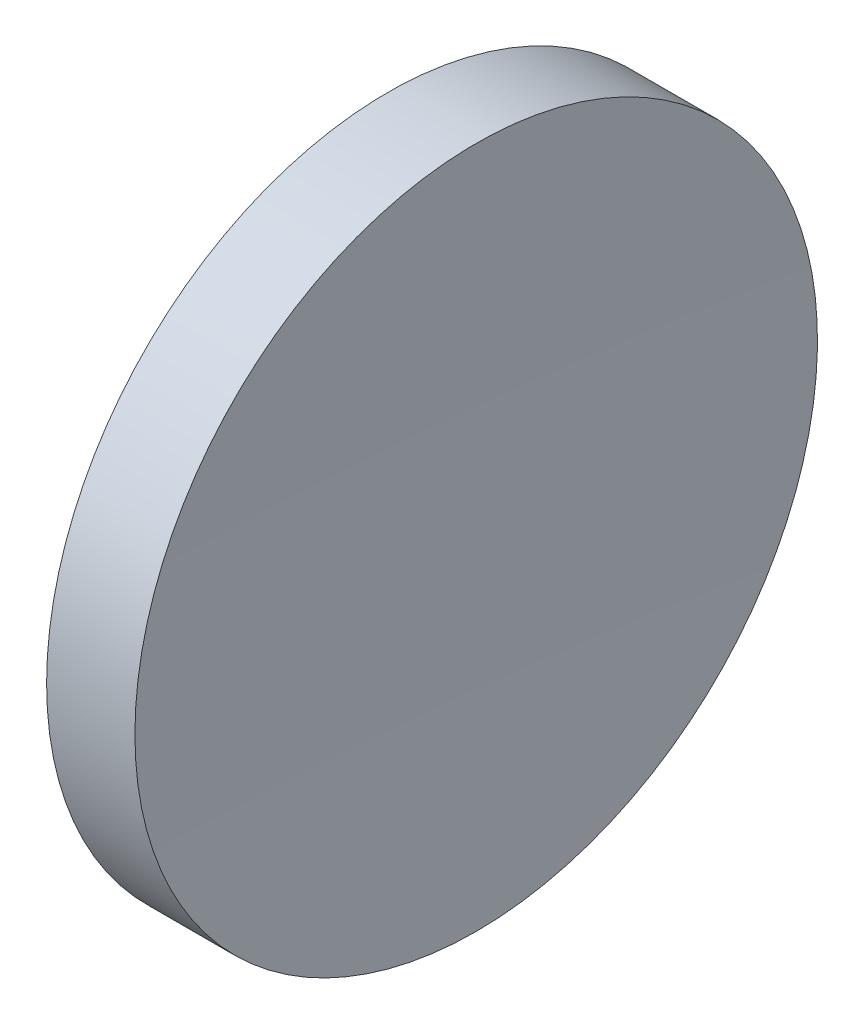
ISO-10303-21;
HEADER;
FILE_DESCRIPTION(('STEP AP214'),'2;1');
FILE_NAME('part.step','',(''),(''),'','','');
FILE_SCHEMA(('AUTOMOTIVE_DESIGN { 1 0 10303 214 1 1 1 1 }'));
ENDSEC;
DATA;
#1=APPLICATION_CONTEXT('core data for automotive mechanical design processes');
#2=APPLICATION_PROTOCOL_DEFINITION('international standard','automotive_design',2000,#1);
#3=PRODUCT_CONTEXT('',#1,'mechanical');
#4=PRODUCT('Part','Part','',(#3));
#5=PRODUCT_RELATED_PRODUCT_CATEGORY('part','',(#4));
#6=PRODUCT_DEFINITION_FORMATION('','',#4);
#7=PRODUCT_DEFINITION_CONTEXT('part definition',#1,'design');
#8=PRODUCT_DEFINITION('design','',#6,#7);
#9=PRODUCT_DEFINITION_SHAPE('','',#8);
#10=(LENGTH_UNIT() NAMED_UNIT(*) SI_UNIT(.MILLI.,.METRE.));
#11=(NAMED_UNIT(*) PLANE_ANGLE_UNIT() SI_UNIT($,.RADIAN.));
#12=(NAMED_UNIT(*) SI_UNIT($,.STERADIAN.) SOLID_ANGLE_UNIT());
#13=UNCERTAINTY_MEASURE_WITH_UNIT(LENGTH_MEASURE(1.E-05),#10,'distance_accuracy_value','');
#14=(GEOMETRIC_REPRESENTATION_CONTEXT(3) GLOBAL_UNCERTAINTY_ASSIGNED_CONTEXT((#13)) GLOBAL_UNIT_ASSIGNED_CONTEXT((#10,
#11,#12)) REPRESENTATION_CONTEXT('',''));
#15=CARTESIAN_POINT('',(0.,0.,0.));
#16=DIRECTION('',(0.,0.,1.));
#17=DIRECTION('',(1.,0.,0.));
#18=AXIS2_PLACEMENT_3D('',#15,#16,#17);
#19=CARTESIAN_POINT('',(1239.19961191361,138.756042246745,0.));
#20=DIRECTION('',(-1.,0.,0.));
#21=DIRECTION('',(0.,-1.,0.));
#22=AXIS2_PLACEMENT_3D('',#19,#20,#21);
#23=SPHERICAL_SURFACE('',#22,1000.);
#24=CARTESIAN_POINT('',(239.902984279956,138.756042246745,0.));
#25=DIRECTION('',(-1.,0.,0.));
#26=DIRECTION('',(0.,0.,1.));
#27=AXIS2_PLACEMENT_3D('',#24,#25,#26);
#28=CIRCLE('',#27,37.5);
#29=CARTESIAN_POINT('',(239.902984279956,138.756042246745,37.5));
#30=VERTEX_POINT('',#29);
#31=EDGE_CURVE('E10',#30,#30,#28,.T.);
#32=ORIENTED_EDGE('',*,*,#31,.F.);
#33=EDGE_LOOP('',(#32));
#34=FACE_BOUND('',#33,.T.);
#35=ADVANCED_FACE('F35',(#34),#23,.F.);
#36=CARTESIAN_POINT('',(217.97028600433,138.756042246745,0.));
#37=DIRECTION('',(-1.,0.,0.));
#38=DIRECTION('',(0.,0.,1.));
#39=AXIS2_PLACEMENT_3D('',#36,#37,#38);
#40=CYLINDRICAL_SURFACE('',#39,37.5);
#41=CARTESIAN_POINT('',(230.199611905266,138.756042246745,0.));
#42=DIRECTION('',(-1.,0.,0.));
#43=DIRECTION('',(0.,0.,1.));
#44=AXIS2_PLACEMENT_3D('',#41,#42,#43);
#45=CIRCLE('',#44,37.5);
#46=CARTESIAN_POINT('',(230.199611905266,138.756042246745,37.5));
#47=VERTEX_POINT('',#46);
#48=EDGE_CURVE('E41',#47,#47,#45,.T.);
#49=ORIENTED_EDGE('',*,*,#48,.F.);
#50=EDGE_LOOP('',(#49));
#51=FACE_BOUND('',#50,.T.);
#52=ORIENTED_EDGE('',*,*,#31,.T.);
#53=EDGE_LOOP('',(#52));
#54=FACE_BOUND('',#53,.T.);
#55=ADVANCED_FACE('F49',(#51,#54),#40,.T.);
#56=CARTESIAN_POINT('',(230.199611905266,138.756042246745,0.));
#57=DIRECTION('',(1.,0.,0.));
#58=DIRECTION('',(0.,0.,-1.));
#59=AXIS2_PLACEMENT_3D('',#56,#57,#58);
#60=PLANE('',#59);
#61=ORIENTED_EDGE('',*,*,#48,.T.);
#62=EDGE_LOOP('',(#61));
#63=FACE_BOUND('',#62,.T.);
#64=ADVANCED_FACE('F47',(#63),#60,.F.);
#65=CLOSED_SHELL('',(#35,#55,#64));
#66=MANIFOLD_SOLID_BREP('B2',#65);
#67=ADVANCED_BREP_SHAPE_REPRESENTATION('',(#18,#66),#14);
#68=SHAPE_DEFINITION_REPRESENTATION(#9,#67);
ENDSEC;
END-ISO-10303-21;
